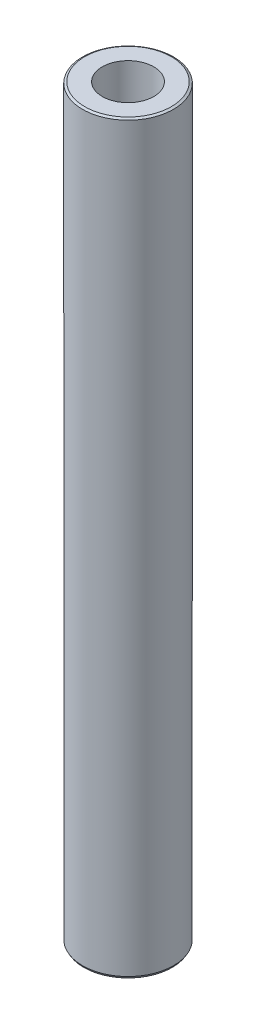
ISO-10303-21;
HEADER;
FILE_DESCRIPTION(('STEP AP214'),'2;1');
FILE_NAME('part.step','',(''),(''),'','','');
FILE_SCHEMA(('AUTOMOTIVE_DESIGN { 1 0 10303 214 1 1 1 1 }'));
ENDSEC;
DATA;
#1=APPLICATION_CONTEXT('core data for automotive mechanical design processes');
#2=APPLICATION_PROTOCOL_DEFINITION('international standard','automotive_design',2000,#1);
#3=PRODUCT_CONTEXT('',#1,'mechanical');
#4=PRODUCT('Part','Part','',(#3));
#5=PRODUCT_RELATED_PRODUCT_CATEGORY('part','',(#4));
#6=PRODUCT_DEFINITION_FORMATION('','',#4);
#7=PRODUCT_DEFINITION_CONTEXT('part definition',#1,'design');
#8=PRODUCT_DEFINITION('design','',#6,#7);
#9=PRODUCT_DEFINITION_SHAPE('','',#8);
#10=(LENGTH_UNIT() NAMED_UNIT(*) SI_UNIT(.MILLI.,.METRE.));
#11=(NAMED_UNIT(*) PLANE_ANGLE_UNIT() SI_UNIT($,.RADIAN.));
#12=(NAMED_UNIT(*) SI_UNIT($,.STERADIAN.) SOLID_ANGLE_UNIT());
#13=UNCERTAINTY_MEASURE_WITH_UNIT(LENGTH_MEASURE(1.E-05),#10,'distance_accuracy_value','');
#14=(GEOMETRIC_REPRESENTATION_CONTEXT(3) GLOBAL_UNCERTAINTY_ASSIGNED_CONTEXT((#13)) GLOBAL_UNIT_ASSIGNED_CONTEXT((#10,
#11,#12)) REPRESENTATION_CONTEXT('',''));
#15=CARTESIAN_POINT('',(0.,0.,0.));
#16=DIRECTION('',(0.,0.,1.));
#17=DIRECTION('',(1.,0.,0.));
#18=AXIS2_PLACEMENT_3D('',#15,#16,#17);
#19=CARTESIAN_POINT('',(0.,573.342076471504,0.));
#20=DIRECTION('',(0.,-1.,0.));
#21=DIRECTION('',(0.,0.,-1.));
#22=AXIS2_PLACEMENT_3D('',#19,#20,#21);
#23=CYLINDRICAL_SURFACE('',#22,35.);
#24=CARTESIAN_POINT('',(0.,572.385900457112,0.));
#25=DIRECTION('',(0.,1.,0.));
#26=DIRECTION('',(0.,0.,1.));
#27=AXIS2_PLACEMENT_3D('',#24,#25,#26);
#28=CIRCLE('',#27,35.);
#29=CARTESIAN_POINT('',(0.,572.385900457112,-35.0000000000001));
#30=VERTEX_POINT('',#29);
#31=EDGE_CURVE('E50',#30,#30,#28,.F.);
#32=ORIENTED_EDGE('',*,*,#31,.T.);
#33=EDGE_LOOP('',(#32));
#34=FACE_BOUND('',#33,.T.);
#35=CARTESIAN_POINT('',(0.,1.65614543790549,0.));
#36=DIRECTION('',(0.,1.,0.));
#37=DIRECTION('',(0.,0.,1.));
#38=AXIS2_PLACEMENT_3D('',#35,#36,#37);
#39=CIRCLE('',#38,35.);
#40=CARTESIAN_POINT('',(0.,1.65614543790549,35.));
#41=VERTEX_POINT('',#40);
#42=EDGE_CURVE('E51',#41,#41,#39,.T.);
#43=ORIENTED_EDGE('',*,*,#42,.T.);
#44=EDGE_LOOP('',(#43));
#45=FACE_BOUND('',#44,.T.);
#46=ADVANCED_FACE('F39',(#34,#45),#23,.T.);
#47=CARTESIAN_POINT('',(0.,573.342076471504,0.));
#48=DIRECTION('',(0.,1.,0.));
#49=DIRECTION('',(0.,0.,1.));
#50=AXIS2_PLACEMENT_3D('',#47,#48,#49);
#51=PLANE('',#50);
#52=CARTESIAN_POINT('',(0.,573.342076471504,0.));
#53=DIRECTION('',(0.,1.,0.));
#54=DIRECTION('',(0.,0.,1.));
#55=AXIS2_PLACEMENT_3D('',#52,#53,#54);
#56=CIRCLE('',#55,33.3438545620942);
#57=CARTESIAN_POINT('',(0.,573.342076471504,-33.3438545620943));
#58=VERTEX_POINT('',#57);
#59=EDGE_CURVE('E54',#58,#58,#56,.T.);
#60=ORIENTED_EDGE('',*,*,#59,.T.);
#61=EDGE_LOOP('',(#60));
#62=FACE_BOUND('',#61,.T.);
#63=CARTESIAN_POINT('',(0.,573.342076471504,0.));
#64=DIRECTION('',(0.,1.,0.));
#65=DIRECTION('',(0.,0.,1.));
#66=AXIS2_PLACEMENT_3D('',#63,#64,#65);
#67=CIRCLE('',#66,19.8360976889947);
#68=CARTESIAN_POINT('',(0.,573.342076471504,19.8360976889947));
#69=VERTEX_POINT('',#68);
#70=EDGE_CURVE('E58',#69,#69,#67,.T.);
#71=ORIENTED_EDGE('',*,*,#70,.F.);
#72=EDGE_LOOP('',(#71));
#73=FACE_BOUND('',#72,.T.);
#74=ADVANCED_FACE('F69',(#62,#73),#51,.T.);
#75=CARTESIAN_POINT('',(0.,0.,0.));
#76=DIRECTION('',(0.,1.,0.));
#77=DIRECTION('',(0.,0.,1.));
#78=AXIS2_PLACEMENT_3D('',#75,#76,#77);
#79=PLANE('',#78);
#80=CARTESIAN_POINT('',(0.,0.,0.));
#81=DIRECTION('',(0.,1.,0.));
#82=DIRECTION('',(0.,0.,1.));
#83=AXIS2_PLACEMENT_3D('',#80,#81,#82);
#84=CIRCLE('',#83,34.0438239856081);
#85=CARTESIAN_POINT('',(0.,0.,34.0438239856081));
#86=VERTEX_POINT('',#85);
#87=EDGE_CURVE('E10',#86,#86,#84,.F.);
#88=ORIENTED_EDGE('',*,*,#87,.T.);
#89=EDGE_LOOP('',(#88));
#90=FACE_BOUND('',#89,.T.);
#91=CARTESIAN_POINT('',(0.,0.,0.));
#92=DIRECTION('',(0.,1.,0.));
#93=DIRECTION('',(0.,0.,1.));
#94=AXIS2_PLACEMENT_3D('',#91,#92,#93);
#95=CIRCLE('',#94,19.8360976889947);
#96=CARTESIAN_POINT('',(0.,0.,19.8360976889947));
#97=VERTEX_POINT('',#96);
#98=EDGE_CURVE('E63',#97,#97,#95,.T.);
#99=ORIENTED_EDGE('',*,*,#98,.T.);
#100=EDGE_LOOP('',(#99));
#101=FACE_BOUND('',#100,.T.);
#102=ADVANCED_FACE('F75',(#90,#101),#79,.F.);
#103=CARTESIAN_POINT('',(0.,573.342076471504,0.));
#104=DIRECTION('',(0.,-1.,0.));
#105=DIRECTION('',(0.,0.,-1.));
#106=AXIS2_PLACEMENT_3D('',#103,#104,#105);
#107=CYLINDRICAL_SURFACE('',#106,19.8360976889947);
#108=ORIENTED_EDGE('',*,*,#70,.T.);
#109=EDGE_LOOP('',(#108));
#110=FACE_BOUND('',#109,.T.);
#111=ORIENTED_EDGE('',*,*,#98,.F.);
#112=EDGE_LOOP('',(#111));
#113=FACE_BOUND('',#112,.T.);
#114=ADVANCED_FACE('F70',(#110,#113),#107,.F.);
#115=CARTESIAN_POINT('',(0.,573.342076471504,0.));
#116=DIRECTION('',(0.,-1.,0.));
#117=DIRECTION('',(0.,0.,-1.));
#118=AXIS2_PLACEMENT_3D('',#115,#116,#117);
#119=CONICAL_SURFACE('',#118,33.3438545620942,1.04719755119658);
#120=CARTESIAN_POINT('',(0.,572.385900457112,-35.0000000000001));
#121=CARTESIAN_POINT('',(0.,572.395860623928,-34.9827484850219));
#122=CARTESIAN_POINT('',(0.,572.405820790745,-34.9654969700437));
#123=CARTESIAN_POINT('',(0.,572.425741124378,-34.9309939400874));
#124=CARTESIAN_POINT('',(0.,572.435701291195,-34.9137424251092));
#125=CARTESIAN_POINT('',(0.,572.455621624828,-34.8792393951528));
#126=CARTESIAN_POINT('',(0.,572.465581791644,-34.8619878801746));
#127=CARTESIAN_POINT('',(0.,572.485502125277,-34.8274848502182));
#128=CARTESIAN_POINT('',(0.,572.495462292094,-34.8102333352401));
#129=CARTESIAN_POINT('',(0.,572.515382625727,-34.7757303052837));
#130=CARTESIAN_POINT('',(0.,572.525342792544,-34.7584787903055));
#131=CARTESIAN_POINT('',(0.,572.545263126177,-34.7239757603491));
#132=CARTESIAN_POINT('',(0.,572.555223292993,-34.7067242453709));
#133=CARTESIAN_POINT('',(0.,572.575143626627,-34.6722212154146));
#134=CARTESIAN_POINT('',(0.,572.585103793443,-34.6549697004364));
#135=CARTESIAN_POINT('',(0.,572.605024127077,-34.62046667048));
#136=CARTESIAN_POINT('',(0.,572.614984293893,-34.6032151555019));
#137=CARTESIAN_POINT('',(0.,572.634904627526,-34.5687121255455));
#138=CARTESIAN_POINT('',(0.,572.644864794343,-34.5514606105673));
#139=CARTESIAN_POINT('',(0.,572.664785127976,-34.5169575806109));
#140=CARTESIAN_POINT('',(0.,572.674745294793,-34.4997060656327));
#141=CARTESIAN_POINT('',(0.,572.694665628426,-34.4652030356764));
#142=CARTESIAN_POINT('',(0.,572.704625795242,-34.4479515206982));
#143=CARTESIAN_POINT('',(0.,572.724546128875,-34.4134484907418));
#144=CARTESIAN_POINT('',(0.,572.734506295692,-34.3961969757636));
#145=CARTESIAN_POINT('',(0.,572.754426629325,-34.3616939458072));
#146=CARTESIAN_POINT('',(0.,572.764386796142,-34.3444424308291));
#147=CARTESIAN_POINT('',(0.,572.784307129775,-34.3099394008727));
#148=CARTESIAN_POINT('',(0.,572.794267296592,-34.2926878858945));
#149=CARTESIAN_POINT('',(0.,572.814187630225,-34.2581848559381));
#150=CARTESIAN_POINT('',(0.,572.824147797041,-34.2409333409599));
#151=CARTESIAN_POINT('',(0.,572.844068130674,-34.2064303110036));
#152=CARTESIAN_POINT('',(0.,572.854028297491,-34.1891787960254));
#153=CARTESIAN_POINT('',(0.,572.873948631124,-34.154675766069));
#154=CARTESIAN_POINT('',(0.,572.883908797941,-34.1374242510908));
#155=CARTESIAN_POINT('',(0.,572.903829131574,-34.1029212211345));
#156=CARTESIAN_POINT('',(0.,572.913789298391,-34.0856697061563));
#157=CARTESIAN_POINT('',(0.,572.933709632024,-34.0511666761999));
#158=CARTESIAN_POINT('',(0.,572.94366979884,-34.0339151612217));
#159=CARTESIAN_POINT('',(0.,572.963590132474,-33.9994121312654));
#160=CARTESIAN_POINT('',(0.,572.97355029929,-33.9821606162872));
#161=CARTESIAN_POINT('',(0.,572.993470632923,-33.9476575863308));
#162=CARTESIAN_POINT('',(0.,573.00343079974,-33.9304060713526));
#163=CARTESIAN_POINT('',(0.,573.023351133373,-33.8959030413962));
#164=CARTESIAN_POINT('',(0.,573.03331130019,-33.878651526418));
#165=CARTESIAN_POINT('',(0.,573.053231633823,-33.8441484964617));
#166=CARTESIAN_POINT('',(0.,573.063191800639,-33.8268969814835));
#167=CARTESIAN_POINT('',(0.,573.083112134273,-33.7923939515271));
#168=CARTESIAN_POINT('',(0.,573.093072301089,-33.7751424365489));
#169=CARTESIAN_POINT('',(0.,573.112992634722,-33.7406394065926));
#170=CARTESIAN_POINT('',(0.,573.122952801539,-33.7233878916144));
#171=CARTESIAN_POINT('',(0.,573.142873135172,-33.688884861658));
#172=CARTESIAN_POINT('',(0.,573.152833301989,-33.6716333466798));
#173=CARTESIAN_POINT('',(0.,573.172753635622,-33.6371303167235));
#174=CARTESIAN_POINT('',(0.,573.182713802438,-33.6198788017453));
#175=CARTESIAN_POINT('',(0.,573.202634136072,-33.5853757717889));
#176=CARTESIAN_POINT('',(0.,573.212594302888,-33.5681242568107));
#177=CARTESIAN_POINT('',(0.,573.232514636521,-33.5336212268543));
#178=CARTESIAN_POINT('',(0.,573.242474803338,-33.5163697118762));
#179=CARTESIAN_POINT('',(0.,573.262395136971,-33.4818666819198));
#180=CARTESIAN_POINT('',(0.,573.272355303788,-33.4646151669416));
#181=CARTESIAN_POINT('',(0.,573.292275637421,-33.4301121369852));
#182=CARTESIAN_POINT('',(0.,573.302235804237,-33.412860622007));
#183=CARTESIAN_POINT('',(0.,573.322156137871,-33.3783575920507));
#184=CARTESIAN_POINT('',(0.,573.332116304687,-33.3611060770725));
#185=CARTESIAN_POINT('',(0.,573.342076471504,-33.3438545620943));
#186=B_SPLINE_CURVE_WITH_KNOTS('',3,(#120,#121,#122,#123,#124,#125,#126,#127,#128,#129,#130,
#131,#132,#133,#134,#135,#136,#137,#138,#139,#140,#141,#142,#143,#144,#145,#146,#147,#148,#149,
#150,#151,#152,#153,#154,#155,#156,#157,#158,#159,#160,#161,#162,#163,#164,#165,#166,#167,#168,
#169,#170,#171,#172,#173,#174,#175,#176,#177,#178,#179,#180,#181,#182,#183,#184,#185),
.UNSPECIFIED.,.F.,.F.,(4,2,2,2,2,2,2,2,2,2,2,2,2,2,2,2,2,2,2,2,2,2,2,2,2,2,2,2,2,2,2,2,4),(0.,
0.0597610008995447,0.119522001799034,0.179283002698523,0.239044003598068,0.298805004497557,
0.358566005397046,0.418327006296585,0.478088007196074,0.537849008095563,0.597610008995108,
0.657371009894597,0.717132010794086,0.776893011693631,0.83665401259312,0.89641501349261,
0.956176014392099,1.01593701529164,1.07569801619113,1.13545901709062,1.19522001799016,
1.25498101888965,1.31474201978914,1.37450302068868,1.43426402158817,1.49402502248766,
1.55378602338721,1.6135470242867,1.67330802518619,1.73306902608572,1.79283002698521,
1.8525910278847,1.91235202878425),.UNSPECIFIED.);
#187=EDGE_CURVE('BSEAM81',#30,#58,#186,.T.);
#188=ORIENTED_EDGE('',*,*,#31,.F.);
#189=ORIENTED_EDGE('',*,*,#59,.F.);
#190=ORIENTED_EDGE('',*,*,#187,.T.);
#191=ORIENTED_EDGE('',*,*,#187,.F.);
#192=EDGE_LOOP('',(#188,#190,#189,#191));
#193=FACE_BOUND('',#192,.T.);
#194=ADVANCED_FACE('F81',(#193),#119,.T.);
#195=CARTESIAN_POINT('',(0.,1.65614543790549,0.));
#196=DIRECTION('',(0.,1.,0.));
#197=DIRECTION('',(0.,0.,1.));
#198=AXIS2_PLACEMENT_3D('',#195,#196,#197);
#199=CONICAL_SURFACE('',#198,35.,0.523598775598291);
#200=ORIENTED_EDGE('',*,*,#87,.F.);
#201=EDGE_LOOP('',(#200));
#202=FACE_BOUND('',#201,.T.);
#203=ORIENTED_EDGE('',*,*,#42,.F.);
#204=EDGE_LOOP('',(#203));
#205=FACE_BOUND('',#204,.T.);
#206=ADVANCED_FACE('F45',(#202,#205),#199,.T.);
#207=CLOSED_SHELL('',(#46,#74,#102,#114,#194,#206));
#208=MANIFOLD_SOLID_BREP('B2',#207);
#209=ADVANCED_BREP_SHAPE_REPRESENTATION('',(#18,#208),#14);
#210=SHAPE_DEFINITION_REPRESENTATION(#9,#209);
ENDSEC;
END-ISO-10303-21;
